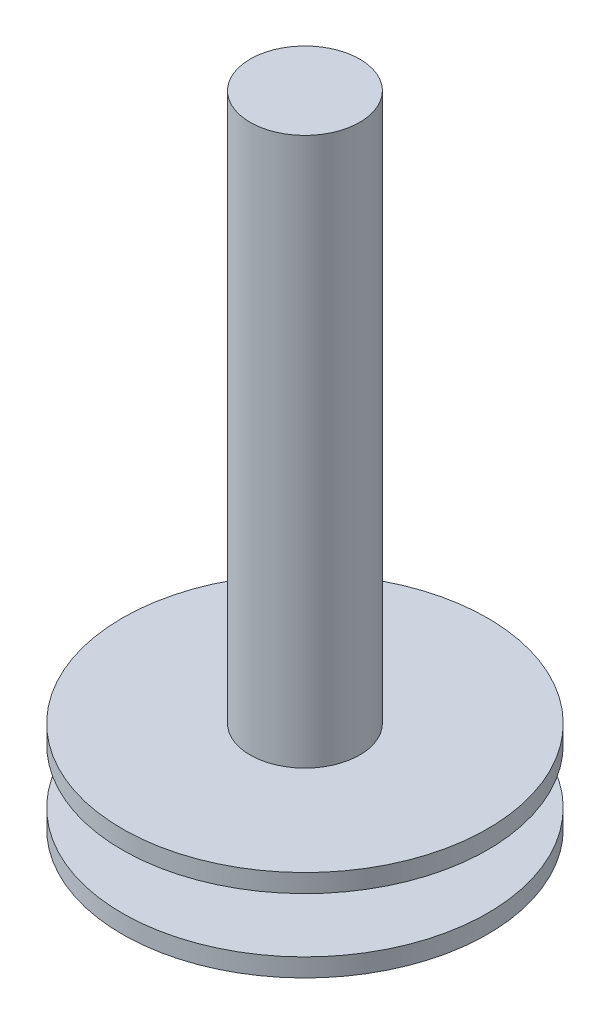
ISO-10303-21;
HEADER;
FILE_DESCRIPTION(('STEP AP214'),'2;1');
FILE_NAME('part.step','',(''),(''),'','','');
FILE_SCHEMA(('AUTOMOTIVE_DESIGN { 1 0 10303 214 1 1 1 1 }'));
ENDSEC;
DATA;
#1=APPLICATION_CONTEXT('core data for automotive mechanical design processes');
#2=APPLICATION_PROTOCOL_DEFINITION('international standard','automotive_design',2000,#1);
#3=PRODUCT_CONTEXT('',#1,'mechanical');
#4=PRODUCT('Part','Part','',(#3));
#5=PRODUCT_RELATED_PRODUCT_CATEGORY('part','',(#4));
#6=PRODUCT_DEFINITION_FORMATION('','',#4);
#7=PRODUCT_DEFINITION_CONTEXT('part definition',#1,'design');
#8=PRODUCT_DEFINITION('design','',#6,#7);
#9=PRODUCT_DEFINITION_SHAPE('','',#8);
#10=(LENGTH_UNIT() NAMED_UNIT(*) SI_UNIT(.MILLI.,.METRE.));
#11=(NAMED_UNIT(*) PLANE_ANGLE_UNIT() SI_UNIT($,.RADIAN.));
#12=(NAMED_UNIT(*) SI_UNIT($,.STERADIAN.) SOLID_ANGLE_UNIT());
#13=UNCERTAINTY_MEASURE_WITH_UNIT(LENGTH_MEASURE(1.E-05),#10,'distance_accuracy_value','');
#14=(GEOMETRIC_REPRESENTATION_CONTEXT(3) GLOBAL_UNCERTAINTY_ASSIGNED_CONTEXT((#13)) GLOBAL_UNIT_ASSIGNED_CONTEXT((#10,
#11,#12)) REPRESENTATION_CONTEXT('',''));
#15=CARTESIAN_POINT('',(0.,0.,0.));
#16=DIRECTION('',(0.,0.,1.));
#17=DIRECTION('',(1.,0.,0.));
#18=AXIS2_PLACEMENT_3D('',#15,#16,#17);
#19=CARTESIAN_POINT('',(0.,0.,0.));
#20=DIRECTION('',(0.,1.,0.));
#21=DIRECTION('',(-1.,0.,0.));
#22=AXIS2_PLACEMENT_3D('',#19,#20,#21);
#23=PLANE('',#22);
#24=CARTESIAN_POINT('',(0.,0.,0.));
#25=DIRECTION('',(0.,1.,0.));
#26=DIRECTION('',(-1.,0.,0.));
#27=AXIS2_PLACEMENT_3D('',#24,#25,#26);
#28=CIRCLE('',#27,10.);
#29=CARTESIAN_POINT('',(-10.,0.,0.));
#30=VERTEX_POINT('',#29);
#31=EDGE_CURVE('E46',#30,#30,#28,.T.);
#32=ORIENTED_EDGE('',*,*,#31,.F.);
#33=EDGE_LOOP('',(#32));
#34=FACE_BOUND('',#33,.T.);
#35=ADVANCED_FACE('F43',(#34),#23,.F.);
#36=CARTESIAN_POINT('',(0.,5.,0.));
#37=DIRECTION('',(0.,1.,0.));
#38=DIRECTION('',(-1.,0.,0.));
#39=AXIS2_PLACEMENT_3D('',#36,#37,#38);
#40=CYLINDRICAL_SURFACE('',#39,10.);
#41=CARTESIAN_POINT('',(0.,1.,0.));
#42=DIRECTION('',(0.,1.,0.));
#43=DIRECTION('',(-1.,0.,0.));
#44=AXIS2_PLACEMENT_3D('',#41,#42,#43);
#45=CIRCLE('',#44,10.);
#46=CARTESIAN_POINT('',(-10.,1.,0.));
#47=VERTEX_POINT('',#46);
#48=EDGE_CURVE('E56',#47,#47,#45,.T.);
#49=ORIENTED_EDGE('',*,*,#48,.F.);
#50=EDGE_LOOP('',(#49));
#51=FACE_BOUND('',#50,.T.);
#52=ORIENTED_EDGE('',*,*,#31,.T.);
#53=EDGE_LOOP('',(#52));
#54=FACE_BOUND('',#53,.T.);
#55=ADVANCED_FACE('F81',(#51,#54),#40,.T.);
#56=CARTESIAN_POINT('',(10.,1.,0.));
#57=DIRECTION('',(0.,-1.,0.));
#58=DIRECTION('',(1.,0.,0.));
#59=AXIS2_PLACEMENT_3D('',#56,#57,#58);
#60=PLANE('',#59);
#61=CARTESIAN_POINT('',(0.,0.999999999999999,0.));
#62=DIRECTION('',(0.,1.,0.));
#63=DIRECTION('',(-1.,0.,0.));
#64=AXIS2_PLACEMENT_3D('',#61,#62,#63);
#65=CIRCLE('',#64,5.);
#66=CARTESIAN_POINT('',(-5.,0.999999999999999,0.));
#67=VERTEX_POINT('',#66);
#68=EDGE_CURVE('E72',#67,#67,#65,.T.);
#69=ORIENTED_EDGE('',*,*,#68,.F.);
#70=EDGE_LOOP('',(#69));
#71=FACE_BOUND('',#70,.T.);
#72=ORIENTED_EDGE('',*,*,#48,.T.);
#73=EDGE_LOOP('',(#72));
#74=FACE_BOUND('',#73,.T.);
#75=ADVANCED_FACE('F79',(#71,#74),#60,.F.);
#76=CARTESIAN_POINT('',(0.,5.,0.));
#77=DIRECTION('',(0.,1.,0.));
#78=DIRECTION('',(-1.,0.,0.));
#79=AXIS2_PLACEMENT_3D('',#76,#77,#78);
#80=CYLINDRICAL_SURFACE('',#79,5.);
#81=CARTESIAN_POINT('',(0.,4.,0.));
#82=DIRECTION('',(0.,1.,0.));
#83=DIRECTION('',(-1.,0.,0.));
#84=AXIS2_PLACEMENT_3D('',#81,#82,#83);
#85=CIRCLE('',#84,5.);
#86=CARTESIAN_POINT('',(-5.,4.,0.));
#87=VERTEX_POINT('',#86);
#88=EDGE_CURVE('E68',#87,#87,#85,.T.);
#89=ORIENTED_EDGE('',*,*,#88,.F.);
#90=EDGE_LOOP('',(#89));
#91=FACE_BOUND('',#90,.T.);
#92=ORIENTED_EDGE('',*,*,#68,.T.);
#93=EDGE_LOOP('',(#92));
#94=FACE_BOUND('',#93,.T.);
#95=ADVANCED_FACE('F101',(#91,#94),#80,.T.);
#96=CARTESIAN_POINT('',(5.,4.,0.));
#97=DIRECTION('',(0.,1.,0.));
#98=DIRECTION('',(-1.,0.,0.));
#99=AXIS2_PLACEMENT_3D('',#96,#97,#98);
#100=PLANE('',#99);
#101=CARTESIAN_POINT('',(0.,4.,0.));
#102=DIRECTION('',(0.,1.,0.));
#103=DIRECTION('',(-1.,0.,0.));
#104=AXIS2_PLACEMENT_3D('',#101,#102,#103);
#105=CIRCLE('',#104,10.);
#106=CARTESIAN_POINT('',(-10.,4.,0.));
#107=VERTEX_POINT('',#106);
#108=EDGE_CURVE('E64',#107,#107,#105,.T.);
#109=ORIENTED_EDGE('',*,*,#108,.F.);
#110=EDGE_LOOP('',(#109));
#111=FACE_BOUND('',#110,.T.);
#112=ORIENTED_EDGE('',*,*,#88,.T.);
#113=EDGE_LOOP('',(#112));
#114=FACE_BOUND('',#113,.T.);
#115=ADVANCED_FACE('F110',(#111,#114),#100,.F.);
#116=CARTESIAN_POINT('',(0.,5.,0.));
#117=DIRECTION('',(0.,1.,0.));
#118=DIRECTION('',(-1.,0.,0.));
#119=AXIS2_PLACEMENT_3D('',#116,#117,#118);
#120=CYLINDRICAL_SURFACE('',#119,10.);
#121=CARTESIAN_POINT('',(0.,5.,0.));
#122=DIRECTION('',(0.,1.,0.));
#123=DIRECTION('',(-1.,0.,0.));
#124=AXIS2_PLACEMENT_3D('',#121,#122,#123);
#125=CIRCLE('',#124,10.);
#126=CARTESIAN_POINT('',(-10.,5.,0.));
#127=VERTEX_POINT('',#126);
#128=EDGE_CURVE('E60',#127,#127,#125,.T.);
#129=ORIENTED_EDGE('',*,*,#128,.F.);
#130=EDGE_LOOP('',(#129));
#131=FACE_BOUND('',#130,.T.);
#132=ORIENTED_EDGE('',*,*,#108,.T.);
#133=EDGE_LOOP('',(#132));
#134=FACE_BOUND('',#133,.T.);
#135=ADVANCED_FACE('F119',(#131,#134),#120,.T.);
#136=CARTESIAN_POINT('',(10.,5.,0.));
#137=DIRECTION('',(0.,-1.,0.));
#138=DIRECTION('',(1.,0.,0.));
#139=AXIS2_PLACEMENT_3D('',#136,#137,#138);
#140=PLANE('',#139);
#141=CARTESIAN_POINT('',(0.,5.,0.));
#142=DIRECTION('',(0.,1.,0.));
#143=DIRECTION('',(-1.,0.,0.));
#144=AXIS2_PLACEMENT_3D('',#141,#142,#143);
#145=CIRCLE('',#144,3.);
#146=CARTESIAN_POINT('',(-3.,5.,0.));
#147=VERTEX_POINT('',#146);
#148=EDGE_CURVE('E10',#147,#147,#145,.T.);
#149=ORIENTED_EDGE('',*,*,#148,.F.);
#150=EDGE_LOOP('',(#149));
#151=FACE_BOUND('',#150,.T.);
#152=ORIENTED_EDGE('',*,*,#128,.T.);
#153=EDGE_LOOP('',(#152));
#154=FACE_BOUND('',#153,.T.);
#155=ADVANCED_FACE('F128',(#151,#154),#140,.F.);
#156=CARTESIAN_POINT('',(0.,35.,0.));
#157=DIRECTION('',(0.,-1.,0.));
#158=DIRECTION('',(1.,0.,0.));
#159=AXIS2_PLACEMENT_3D('',#156,#157,#158);
#160=CYLINDRICAL_SURFACE('',#159,3.);
#161=CARTESIAN_POINT('',(0.,35.,0.));
#162=DIRECTION('',(0.,1.,0.));
#163=DIRECTION('',(-1.,0.,0.));
#164=AXIS2_PLACEMENT_3D('',#161,#162,#163);
#165=CIRCLE('',#164,3.);
#166=CARTESIAN_POINT('',(-3.,35.,0.));
#167=VERTEX_POINT('',#166);
#168=EDGE_CURVE('E59',#167,#167,#165,.T.);
#169=ORIENTED_EDGE('',*,*,#168,.F.);
#170=EDGE_LOOP('',(#169));
#171=FACE_BOUND('',#170,.T.);
#172=ORIENTED_EDGE('',*,*,#148,.T.);
#173=EDGE_LOOP('',(#172));
#174=FACE_BOUND('',#173,.T.);
#175=ADVANCED_FACE('F137',(#171,#174),#160,.T.);
#176=CARTESIAN_POINT('',(0.,35.,0.));
#177=DIRECTION('',(0.,1.,0.));
#178=DIRECTION('',(-1.,0.,0.));
#179=AXIS2_PLACEMENT_3D('',#176,#177,#178);
#180=PLANE('',#179);
#181=ORIENTED_EDGE('',*,*,#168,.T.);
#182=EDGE_LOOP('',(#181));
#183=FACE_BOUND('',#182,.T.);
#184=ADVANCED_FACE('F146',(#183),#180,.T.);
#185=CLOSED_SHELL('',(#35,#55,#75,#95,#115,#135,#155,#175,#184));
#186=MANIFOLD_SOLID_BREP('B2',#185);
#187=ADVANCED_BREP_SHAPE_REPRESENTATION('',(#18,#186),#14);
#188=SHAPE_DEFINITION_REPRESENTATION(#9,#187);
ENDSEC;
END-ISO-10303-21;
